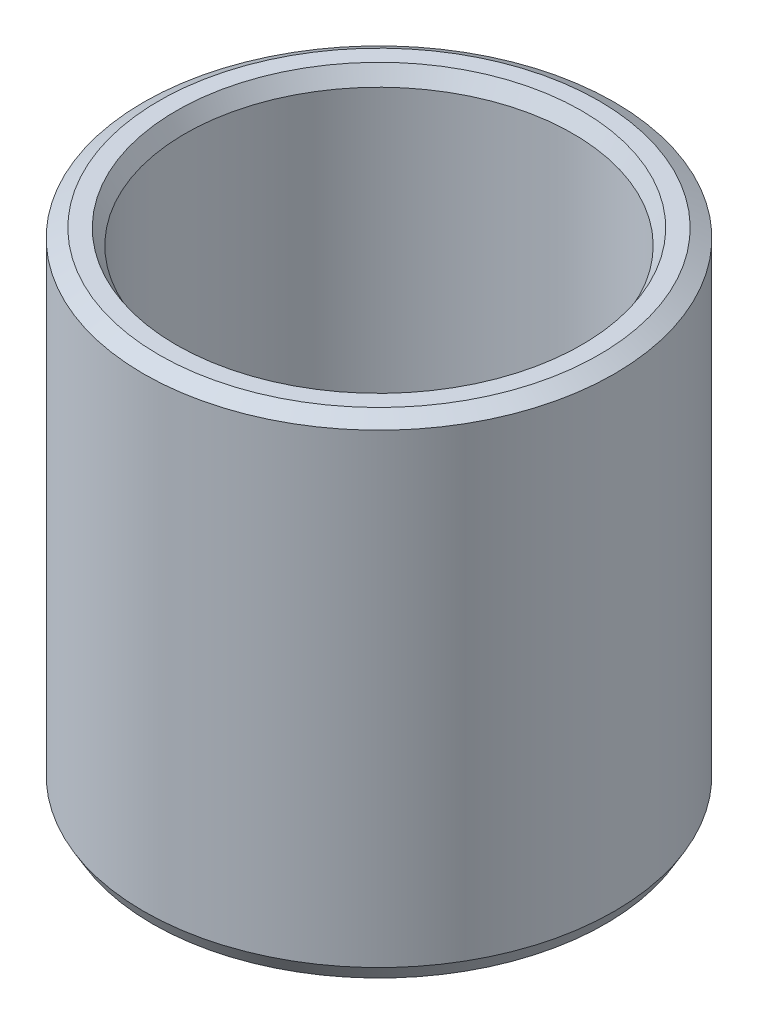
ISO-10303-21;
HEADER;
FILE_DESCRIPTION(('STEP AP214'),'2;1');
FILE_NAME('part.step','',(''),(''),'','','');
FILE_SCHEMA(('AUTOMOTIVE_DESIGN { 1 0 10303 214 1 1 1 1 }'));
ENDSEC;
DATA;
#1=APPLICATION_CONTEXT('core data for automotive mechanical design processes');
#2=APPLICATION_PROTOCOL_DEFINITION('international standard','automotive_design',2000,#1);
#3=PRODUCT_CONTEXT('',#1,'mechanical');
#4=PRODUCT('Part','Part','',(#3));
#5=PRODUCT_RELATED_PRODUCT_CATEGORY('part','',(#4));
#6=PRODUCT_DEFINITION_FORMATION('','',#4);
#7=PRODUCT_DEFINITION_CONTEXT('part definition',#1,'design');
#8=PRODUCT_DEFINITION('design','',#6,#7);
#9=PRODUCT_DEFINITION_SHAPE('','',#8);
#10=(LENGTH_UNIT() NAMED_UNIT(*) SI_UNIT(.MILLI.,.METRE.));
#11=(NAMED_UNIT(*) PLANE_ANGLE_UNIT() SI_UNIT($,.RADIAN.));
#12=(NAMED_UNIT(*) SI_UNIT($,.STERADIAN.) SOLID_ANGLE_UNIT());
#13=UNCERTAINTY_MEASURE_WITH_UNIT(LENGTH_MEASURE(1.E-05),#10,'distance_accuracy_value','');
#14=(GEOMETRIC_REPRESENTATION_CONTEXT(3) GLOBAL_UNCERTAINTY_ASSIGNED_CONTEXT((#13)) GLOBAL_UNIT_ASSIGNED_CONTEXT((#10,
#11,#12)) REPRESENTATION_CONTEXT('',''));
#15=CARTESIAN_POINT('',(0.,0.,0.));
#16=DIRECTION('',(0.,0.,1.));
#17=DIRECTION('',(1.,0.,0.));
#18=AXIS2_PLACEMENT_3D('',#15,#16,#17);
#19=CARTESIAN_POINT('',(0.,77.9990690266649,0.));
#20=DIRECTION('',(0.,-1.,0.));
#21=DIRECTION('',(0.,0.,-1.));
#22=AXIS2_PLACEMENT_3D('',#19,#20,#21);
#23=CYLINDRICAL_SURFACE('',#22,37.5);
#24=CARTESIAN_POINT('',(0.,2.44272389513055,0.));
#25=DIRECTION('',(0.,1.,0.));
#26=DIRECTION('',(0.,0.,1.));
#27=AXIS2_PLACEMENT_3D('',#24,#25,#26);
#28=CIRCLE('',#27,37.5);
#29=CARTESIAN_POINT('',(0.,2.44272389513055,37.5));
#30=VERTEX_POINT('',#29);
#31=EDGE_CURVE('E10',#30,#30,#28,.T.);
#32=ORIENTED_EDGE('',*,*,#31,.T.);
#33=EDGE_LOOP('',(#32));
#34=FACE_BOUND('',#33,.T.);
#35=CARTESIAN_POINT('',(0.,76.5887617282554,0.));
#36=DIRECTION('',(0.,1.,0.));
#37=DIRECTION('',(0.,0.,1.));
#38=AXIS2_PLACEMENT_3D('',#35,#36,#37);
#39=CIRCLE('',#38,37.5);
#40=CARTESIAN_POINT('',(0.,76.5887617282554,37.5));
#41=VERTEX_POINT('',#40);
#42=EDGE_CURVE('E50',#41,#41,#39,.F.);
#43=ORIENTED_EDGE('',*,*,#42,.T.);
#44=EDGE_LOOP('',(#43));
#45=FACE_BOUND('',#44,.T.);
#46=ADVANCED_FACE('F39',(#34,#45),#23,.T.);
#47=CARTESIAN_POINT('',(0.,77.9990690266649,0.));
#48=DIRECTION('',(0.,1.,0.));
#49=DIRECTION('',(0.,0.,1.));
#50=AXIS2_PLACEMENT_3D('',#47,#48,#49);
#51=PLANE('',#50);
#52=CARTESIAN_POINT('',(0.,77.9990690266649,0.));
#53=DIRECTION('',(0.,1.,0.));
#54=DIRECTION('',(0.,0.,1.));
#55=AXIS2_PLACEMENT_3D('',#52,#53,#54);
#56=CIRCLE('',#55,32.3036141567941);
#57=CARTESIAN_POINT('',(0.,77.9990690266649,32.3036141567941));
#58=VERTEX_POINT('',#57);
#59=EDGE_CURVE('E58',#58,#58,#56,.F.);
#60=ORIENTED_EDGE('',*,*,#59,.T.);
#61=EDGE_LOOP('',(#60));
#62=FACE_BOUND('',#61,.T.);
#63=CARTESIAN_POINT('',(0.,77.9990690266649,0.));
#64=DIRECTION('',(0.,1.,0.));
#65=DIRECTION('',(0.,0.,1.));
#66=AXIS2_PLACEMENT_3D('',#63,#64,#65);
#67=CIRCLE('',#66,35.0572761048695);
#68=CARTESIAN_POINT('',(0.,77.9990690266649,35.0572761048695));
#69=VERTEX_POINT('',#68);
#70=EDGE_CURVE('E61',#69,#69,#67,.T.);
#71=ORIENTED_EDGE('',*,*,#70,.T.);
#72=EDGE_LOOP('',(#71));
#73=FACE_BOUND('',#72,.T.);
#74=ADVANCED_FACE('F88',(#62,#73),#51,.T.);
#75=CARTESIAN_POINT('',(0.,0.,0.));
#76=DIRECTION('',(0.,1.,0.));
#77=DIRECTION('',(0.,0.,1.));
#78=AXIS2_PLACEMENT_3D('',#75,#76,#77);
#79=PLANE('',#78);
#80=CARTESIAN_POINT('',(0.,0.,0.));
#81=DIRECTION('',(0.,1.,0.));
#82=DIRECTION('',(0.,0.,1.));
#83=AXIS2_PLACEMENT_3D('',#80,#81,#82);
#84=CIRCLE('',#83,33.3360307535151);
#85=CARTESIAN_POINT('',(0.,0.,33.3360307535151));
#86=VERTEX_POINT('',#85);
#87=EDGE_CURVE('E51',#86,#86,#84,.T.);
#88=ORIENTED_EDGE('',*,*,#87,.T.);
#89=EDGE_LOOP('',(#88));
#90=FACE_BOUND('',#89,.T.);
#91=CARTESIAN_POINT('',(0.,0.,0.));
#92=DIRECTION('',(0.,1.,0.));
#93=DIRECTION('',(0.,0.,1.));
#94=AXIS2_PLACEMENT_3D('',#91,#92,#93);
#95=CIRCLE('',#94,36.0896927015904);
#96=CARTESIAN_POINT('',(0.,0.,36.0896927015904));
#97=VERTEX_POINT('',#96);
#98=EDGE_CURVE('E54',#97,#97,#95,.F.);
#99=ORIENTED_EDGE('',*,*,#98,.T.);
#100=EDGE_LOOP('',(#99));
#101=FACE_BOUND('',#100,.T.);
#102=ADVANCED_FACE('F83',(#90,#101),#79,.F.);
#103=CARTESIAN_POINT('',(0.,77.9990690266649,0.));
#104=DIRECTION('',(0.,-1.,0.));
#105=DIRECTION('',(0.,0.,-1.));
#106=AXIS2_PLACEMENT_3D('',#103,#104,#105);
#107=CYLINDRICAL_SURFACE('',#106,30.8933068583845);
#108=CARTESIAN_POINT('',(0.,75.5563451315343,0.));
#109=DIRECTION('',(0.,1.,0.));
#110=DIRECTION('',(0.,0.,1.));
#111=AXIS2_PLACEMENT_3D('',#108,#109,#110);
#112=CIRCLE('',#111,30.8933068583845);
#113=CARTESIAN_POINT('',(0.,75.5563451315343,30.8933068583845));
#114=VERTEX_POINT('',#113);
#115=EDGE_CURVE('E67',#114,#114,#112,.T.);
#116=ORIENTED_EDGE('',*,*,#115,.T.);
#117=EDGE_LOOP('',(#116));
#118=FACE_BOUND('',#117,.T.);
#119=CARTESIAN_POINT('',(0.,1.41030729840956,0.));
#120=DIRECTION('',(0.,1.,0.));
#121=DIRECTION('',(0.,0.,1.));
#122=AXIS2_PLACEMENT_3D('',#119,#120,#121);
#123=CIRCLE('',#122,30.8933068583845);
#124=CARTESIAN_POINT('',(0.,1.41030729840956,30.8933068583845));
#125=VERTEX_POINT('',#124);
#126=EDGE_CURVE('E69',#125,#125,#123,.F.);
#127=ORIENTED_EDGE('',*,*,#126,.T.);
#128=EDGE_LOOP('',(#127));
#129=FACE_BOUND('',#128,.T.);
#130=ADVANCED_FACE('F71',(#118,#129),#107,.F.);
#131=CARTESIAN_POINT('',(0.,75.5563451315343,0.));
#132=DIRECTION('',(0.,1.,0.));
#133=DIRECTION('',(0.,0.,1.));
#134=AXIS2_PLACEMENT_3D('',#131,#132,#133);
#135=CONICAL_SURFACE('',#134,30.8933068583845,0.523598775598301);
#136=ORIENTED_EDGE('',*,*,#59,.F.);
#137=EDGE_LOOP('',(#136));
#138=FACE_BOUND('',#137,.T.);
#139=ORIENTED_EDGE('',*,*,#115,.F.);
#140=EDGE_LOOP('',(#139));
#141=FACE_BOUND('',#140,.T.);
#142=ADVANCED_FACE('F77',(#138,#141),#135,.F.);
#143=CARTESIAN_POINT('',(0.,0.,0.));
#144=DIRECTION('',(0.,-1.,0.));
#145=DIRECTION('',(0.,0.,-1.));
#146=AXIS2_PLACEMENT_3D('',#143,#144,#145);
#147=CONICAL_SURFACE('',#146,33.3360307535151,1.04719755119659);
#148=ORIENTED_EDGE('',*,*,#126,.F.);
#149=EDGE_LOOP('',(#148));
#150=FACE_BOUND('',#149,.T.);
#151=ORIENTED_EDGE('',*,*,#87,.F.);
#152=EDGE_LOOP('',(#151));
#153=FACE_BOUND('',#152,.T.);
#154=ADVANCED_FACE('F73',(#150,#153),#147,.F.);
#155=CARTESIAN_POINT('',(0.,2.44272389513055,0.));
#156=DIRECTION('',(0.,1.,0.));
#157=DIRECTION('',(0.,0.,1.));
#158=AXIS2_PLACEMENT_3D('',#155,#156,#157);
#159=CONICAL_SURFACE('',#158,37.5,0.523598775598303);
#160=ORIENTED_EDGE('',*,*,#98,.F.);
#161=EDGE_LOOP('',(#160));
#162=FACE_BOUND('',#161,.T.);
#163=ORIENTED_EDGE('',*,*,#31,.F.);
#164=EDGE_LOOP('',(#163));
#165=FACE_BOUND('',#164,.T.);
#166=ADVANCED_FACE('F76',(#162,#165),#159,.T.);
#167=CARTESIAN_POINT('',(0.,77.9990690266649,0.));
#168=DIRECTION('',(0.,-1.,0.));
#169=DIRECTION('',(0.,0.,-1.));
#170=AXIS2_PLACEMENT_3D('',#167,#168,#169);
#171=CONICAL_SURFACE('',#170,35.0572761048695,1.04719755119659);
#172=ORIENTED_EDGE('',*,*,#42,.F.);
#173=EDGE_LOOP('',(#172));
#174=FACE_BOUND('',#173,.T.);
#175=ORIENTED_EDGE('',*,*,#70,.F.);
#176=EDGE_LOOP('',(#175));
#177=FACE_BOUND('',#176,.T.);
#178=ADVANCED_FACE('F45',(#174,#177),#171,.T.);
#179=CLOSED_SHELL('',(#46,#74,#102,#130,#142,#154,#166,#178));
#180=MANIFOLD_SOLID_BREP('B2',#179);
#181=ADVANCED_BREP_SHAPE_REPRESENTATION('',(#18,#180),#14);
#182=SHAPE_DEFINITION_REPRESENTATION(#9,#181);
ENDSEC;
END-ISO-10303-21;
